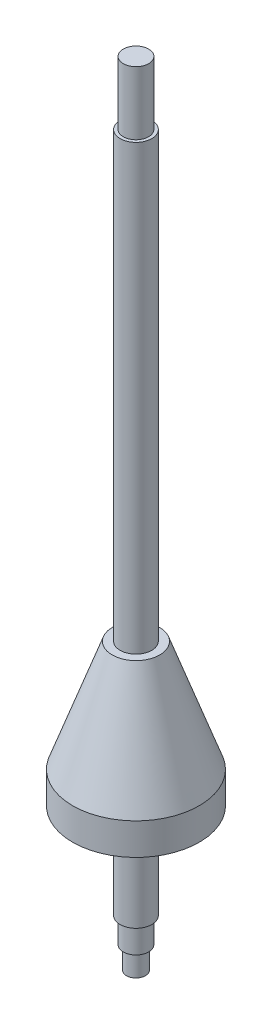
ISO-10303-21;
HEADER;
FILE_DESCRIPTION(('STEP AP214'),'2;1');
FILE_NAME('part.step','',(''),(''),'','','');
FILE_SCHEMA(('AUTOMOTIVE_DESIGN { 1 0 10303 214 1 1 1 1 }'));
ENDSEC;
DATA;
#1=APPLICATION_CONTEXT('core data for automotive mechanical design processes');
#2=APPLICATION_PROTOCOL_DEFINITION('international standard','automotive_design',2000,#1);
#3=PRODUCT_CONTEXT('',#1,'mechanical');
#4=PRODUCT('Part','Part','',(#3));
#5=PRODUCT_RELATED_PRODUCT_CATEGORY('part','',(#4));
#6=PRODUCT_DEFINITION_FORMATION('','',#4);
#7=PRODUCT_DEFINITION_CONTEXT('part definition',#1,'design');
#8=PRODUCT_DEFINITION('design','',#6,#7);
#9=PRODUCT_DEFINITION_SHAPE('','',#8);
#10=(LENGTH_UNIT() NAMED_UNIT(*) SI_UNIT(.MILLI.,.METRE.));
#11=(NAMED_UNIT(*) PLANE_ANGLE_UNIT() SI_UNIT($,.RADIAN.));
#12=(NAMED_UNIT(*) SI_UNIT($,.STERADIAN.) SOLID_ANGLE_UNIT());
#13=UNCERTAINTY_MEASURE_WITH_UNIT(LENGTH_MEASURE(1.E-05),#10,'distance_accuracy_value','');
#14=(GEOMETRIC_REPRESENTATION_CONTEXT(3) GLOBAL_UNCERTAINTY_ASSIGNED_CONTEXT((#13)) GLOBAL_UNIT_ASSIGNED_CONTEXT((#10,
#11,#12)) REPRESENTATION_CONTEXT('',''));
#15=CARTESIAN_POINT('',(0.,0.,0.));
#16=DIRECTION('',(0.,0.,1.));
#17=DIRECTION('',(1.,0.,0.));
#18=AXIS2_PLACEMENT_3D('',#15,#16,#17);
#19=CARTESIAN_POINT('',(0.,266.579730289978,0.));
#20=DIRECTION('',(0.,1.,0.));
#21=DIRECTION('',(0.,0.,1.));
#22=AXIS2_PLACEMENT_3D('',#19,#20,#21);
#23=CYLINDRICAL_SURFACE('',#22,20.);
#24=CARTESIAN_POINT('',(0.,10.,0.));
#25=DIRECTION('',(0.,1.,0.));
#26=DIRECTION('',(0.,0.,1.));
#27=AXIS2_PLACEMENT_3D('',#24,#25,#26);
#28=CIRCLE('',#27,20.);
#29=CARTESIAN_POINT('',(0.,10.,20.));
#30=VERTEX_POINT('',#29);
#31=EDGE_CURVE('E10',#30,#30,#28,.T.);
#32=ORIENTED_EDGE('',*,*,#31,.F.);
#33=EDGE_LOOP('',(#32));
#34=FACE_BOUND('',#33,.T.);
#35=CARTESIAN_POINT('',(0.,0.,0.));
#36=DIRECTION('',(0.,1.,0.));
#37=DIRECTION('',(0.,0.,1.));
#38=AXIS2_PLACEMENT_3D('',#35,#36,#37);
#39=CIRCLE('',#38,20.);
#40=CARTESIAN_POINT('',(0.,0.,20.));
#41=VERTEX_POINT('',#40);
#42=EDGE_CURVE('E80',#41,#41,#39,.T.);
#43=ORIENTED_EDGE('',*,*,#42,.T.);
#44=EDGE_LOOP('',(#43));
#45=FACE_BOUND('',#44,.T.);
#46=ADVANCED_FACE('F31',(#34,#45),#23,.T.);
#47=CARTESIAN_POINT('',(0.,10.,0.));
#48=DIRECTION('',(0.,-1.,0.));
#49=DIRECTION('',(0.,0.,-1.));
#50=AXIS2_PLACEMENT_3D('',#47,#48,#49);
#51=CONICAL_SURFACE('',#50,20.,0.343023940420703);
#52=CARTESIAN_POINT('',(0.,45.,0.));
#53=DIRECTION('',(0.,1.,0.));
#54=DIRECTION('',(0.,0.,1.));
#55=AXIS2_PLACEMENT_3D('',#52,#53,#54);
#56=CIRCLE('',#55,7.50000000000002);
#57=CARTESIAN_POINT('',(0.,45.,7.50000000000002));
#58=VERTEX_POINT('',#57);
#59=EDGE_CURVE('E37',#58,#58,#56,.T.);
#60=ORIENTED_EDGE('',*,*,#59,.F.);
#61=EDGE_LOOP('',(#60));
#62=FACE_BOUND('',#61,.T.);
#63=ORIENTED_EDGE('',*,*,#31,.T.);
#64=EDGE_LOOP('',(#63));
#65=FACE_BOUND('',#64,.T.);
#66=ADVANCED_FACE('F144',(#62,#65),#51,.T.);
#67=CARTESIAN_POINT('',(7.50000000000002,45.,0.));
#68=DIRECTION('',(0.,-1.,0.));
#69=DIRECTION('',(0.,0.,-1.));
#70=AXIS2_PLACEMENT_3D('',#67,#68,#69);
#71=PLANE('',#70);
#72=CARTESIAN_POINT('',(0.,45.,0.));
#73=DIRECTION('',(0.,1.,0.));
#74=DIRECTION('',(0.,0.,1.));
#75=AXIS2_PLACEMENT_3D('',#72,#73,#74);
#76=CIRCLE('',#75,5.00000000000001);
#77=CARTESIAN_POINT('',(0.,45.,5.00000000000001));
#78=VERTEX_POINT('',#77);
#79=EDGE_CURVE('E41',#78,#78,#76,.T.);
#80=ORIENTED_EDGE('',*,*,#79,.F.);
#81=EDGE_LOOP('',(#80));
#82=FACE_BOUND('',#81,.T.);
#83=ORIENTED_EDGE('',*,*,#59,.T.);
#84=EDGE_LOOP('',(#83));
#85=FACE_BOUND('',#84,.T.);
#86=ADVANCED_FACE('F149',(#82,#85),#71,.F.);
#87=CARTESIAN_POINT('',(0.,266.579730289978,0.));
#88=DIRECTION('',(0.,1.,0.));
#89=DIRECTION('',(0.,0.,1.));
#90=AXIS2_PLACEMENT_3D('',#87,#88,#89);
#91=CYLINDRICAL_SURFACE('',#90,5.);
#92=CARTESIAN_POINT('',(0.,185.,0.));
#93=DIRECTION('',(0.,1.,0.));
#94=DIRECTION('',(0.,0.,1.));
#95=AXIS2_PLACEMENT_3D('',#92,#93,#94);
#96=CIRCLE('',#95,5.);
#97=CARTESIAN_POINT('',(0.,185.,5.));
#98=VERTEX_POINT('',#97);
#99=EDGE_CURVE('E45',#98,#98,#96,.T.);
#100=ORIENTED_EDGE('',*,*,#99,.F.);
#101=EDGE_LOOP('',(#100));
#102=FACE_BOUND('',#101,.T.);
#103=ORIENTED_EDGE('',*,*,#79,.T.);
#104=EDGE_LOOP('',(#103));
#105=FACE_BOUND('',#104,.T.);
#106=ADVANCED_FACE('F154',(#102,#105),#91,.T.);
#107=CARTESIAN_POINT('',(5.,185.,0.));
#108=DIRECTION('',(0.,-1.,0.));
#109=DIRECTION('',(0.,0.,-1.));
#110=AXIS2_PLACEMENT_3D('',#107,#108,#109);
#111=PLANE('',#110);
#112=CARTESIAN_POINT('',(0.,185.,0.));
#113=DIRECTION('',(0.,1.,0.));
#114=DIRECTION('',(0.,0.,1.));
#115=AXIS2_PLACEMENT_3D('',#112,#113,#114);
#116=CIRCLE('',#115,4.00000000000001);
#117=CARTESIAN_POINT('',(0.,185.,4.00000000000001));
#118=VERTEX_POINT('',#117);
#119=EDGE_CURVE('E50',#118,#118,#116,.T.);
#120=ORIENTED_EDGE('',*,*,#119,.F.);
#121=EDGE_LOOP('',(#120));
#122=FACE_BOUND('',#121,.T.);
#123=ORIENTED_EDGE('',*,*,#99,.T.);
#124=EDGE_LOOP('',(#123));
#125=FACE_BOUND('',#124,.T.);
#126=ADVANCED_FACE('F160',(#122,#125),#111,.F.);
#127=CARTESIAN_POINT('',(0.,266.579730289978,0.));
#128=DIRECTION('',(0.,1.,0.));
#129=DIRECTION('',(0.,0.,1.));
#130=AXIS2_PLACEMENT_3D('',#127,#128,#129);
#131=CYLINDRICAL_SURFACE('',#130,4.);
#132=CARTESIAN_POINT('',(0.,205.,0.));
#133=DIRECTION('',(0.,1.,0.));
#134=DIRECTION('',(0.,0.,1.));
#135=AXIS2_PLACEMENT_3D('',#132,#133,#134);
#136=CIRCLE('',#135,4.);
#137=CARTESIAN_POINT('',(0.,205.,4.));
#138=VERTEX_POINT('',#137);
#139=EDGE_CURVE('E53',#138,#138,#136,.T.);
#140=ORIENTED_EDGE('',*,*,#139,.F.);
#141=EDGE_LOOP('',(#140));
#142=FACE_BOUND('',#141,.T.);
#143=ORIENTED_EDGE('',*,*,#119,.T.);
#144=EDGE_LOOP('',(#143));
#145=FACE_BOUND('',#144,.T.);
#146=ADVANCED_FACE('F140',(#142,#145),#131,.T.);
#147=CARTESIAN_POINT('',(4.,205.,0.));
#148=DIRECTION('',(0.,-1.,0.));
#149=DIRECTION('',(0.,0.,-1.));
#150=AXIS2_PLACEMENT_3D('',#147,#148,#149);
#151=PLANE('',#150);
#152=ORIENTED_EDGE('',*,*,#139,.T.);
#153=EDGE_LOOP('',(#152));
#154=FACE_BOUND('',#153,.T.);
#155=ADVANCED_FACE('F135',(#154),#151,.F.);
#156=CARTESIAN_POINT('',(3.00000000000003,-45.,0.));
#157=DIRECTION('',(0.,1.,0.));
#158=DIRECTION('',(0.,0.,1.));
#159=AXIS2_PLACEMENT_3D('',#156,#157,#158);
#160=PLANE('',#159);
#161=CARTESIAN_POINT('',(0.,-45.,0.));
#162=DIRECTION('',(0.,1.,0.));
#163=DIRECTION('',(0.,0.,1.));
#164=AXIS2_PLACEMENT_3D('',#161,#162,#163);
#165=CIRCLE('',#164,3.00000000000003);
#166=CARTESIAN_POINT('',(0.,-45.,3.00000000000003));
#167=VERTEX_POINT('',#166);
#168=EDGE_CURVE('E56',#167,#167,#165,.T.);
#169=ORIENTED_EDGE('',*,*,#168,.F.);
#170=EDGE_LOOP('',(#169));
#171=FACE_BOUND('',#170,.T.);
#172=ADVANCED_FACE('F130',(#171),#160,.F.);
#173=CARTESIAN_POINT('',(0.,266.579730289978,0.));
#174=DIRECTION('',(0.,1.,0.));
#175=DIRECTION('',(0.,0.,1.));
#176=AXIS2_PLACEMENT_3D('',#173,#174,#175);
#177=CYLINDRICAL_SURFACE('',#176,3.00000000000003);
#178=CARTESIAN_POINT('',(0.,-38.,0.));
#179=DIRECTION('',(0.,1.,0.));
#180=DIRECTION('',(0.,0.,1.));
#181=AXIS2_PLACEMENT_3D('',#178,#179,#180);
#182=CIRCLE('',#181,3.00000000000003);
#183=CARTESIAN_POINT('',(0.,-38.,3.00000000000003));
#184=VERTEX_POINT('',#183);
#185=EDGE_CURVE('E59',#184,#184,#182,.T.);
#186=ORIENTED_EDGE('',*,*,#185,.F.);
#187=EDGE_LOOP('',(#186));
#188=FACE_BOUND('',#187,.T.);
#189=ORIENTED_EDGE('',*,*,#168,.T.);
#190=EDGE_LOOP('',(#189));
#191=FACE_BOUND('',#190,.T.);
#192=ADVANCED_FACE('F124',(#188,#191),#177,.T.);
#193=CARTESIAN_POINT('',(4.00000000000003,-38.,0.));
#194=DIRECTION('',(0.,1.,0.));
#195=DIRECTION('',(0.,0.,1.));
#196=AXIS2_PLACEMENT_3D('',#193,#194,#195);
#197=PLANE('',#196);
#198=CARTESIAN_POINT('',(0.,-38.,0.));
#199=DIRECTION('',(0.,1.,0.));
#200=DIRECTION('',(0.,0.,1.));
#201=AXIS2_PLACEMENT_3D('',#198,#199,#200);
#202=CIRCLE('',#201,4.00000000000003);
#203=CARTESIAN_POINT('',(0.,-38.,4.00000000000003));
#204=VERTEX_POINT('',#203);
#205=EDGE_CURVE('E62',#204,#204,#202,.T.);
#206=ORIENTED_EDGE('',*,*,#205,.F.);
#207=EDGE_LOOP('',(#206));
#208=FACE_BOUND('',#207,.T.);
#209=ORIENTED_EDGE('',*,*,#185,.T.);
#210=EDGE_LOOP('',(#209));
#211=FACE_BOUND('',#210,.T.);
#212=ADVANCED_FACE('F118',(#208,#211),#197,.F.);
#213=CARTESIAN_POINT('',(0.,266.579730289978,0.));
#214=DIRECTION('',(0.,1.,0.));
#215=DIRECTION('',(0.,0.,1.));
#216=AXIS2_PLACEMENT_3D('',#213,#214,#215);
#217=CYLINDRICAL_SURFACE('',#216,4.00000000000003);
#218=CARTESIAN_POINT('',(0.,-30.,0.));
#219=DIRECTION('',(0.,1.,0.));
#220=DIRECTION('',(0.,0.,1.));
#221=AXIS2_PLACEMENT_3D('',#218,#219,#220);
#222=CIRCLE('',#221,4.00000000000003);
#223=CARTESIAN_POINT('',(0.,-30.,4.00000000000003));
#224=VERTEX_POINT('',#223);
#225=EDGE_CURVE('E65',#224,#224,#222,.T.);
#226=ORIENTED_EDGE('',*,*,#225,.F.);
#227=EDGE_LOOP('',(#226));
#228=FACE_BOUND('',#227,.T.);
#229=ORIENTED_EDGE('',*,*,#205,.T.);
#230=EDGE_LOOP('',(#229));
#231=FACE_BOUND('',#230,.T.);
#232=ADVANCED_FACE('F112',(#228,#231),#217,.T.);
#233=CARTESIAN_POINT('',(5.00000000000003,-30.,0.));
#234=DIRECTION('',(0.,1.,0.));
#235=DIRECTION('',(0.,0.,1.));
#236=AXIS2_PLACEMENT_3D('',#233,#234,#235);
#237=PLANE('',#236);
#238=CARTESIAN_POINT('',(0.,-30.,0.));
#239=DIRECTION('',(0.,1.,0.));
#240=DIRECTION('',(0.,0.,1.));
#241=AXIS2_PLACEMENT_3D('',#238,#239,#240);
#242=CIRCLE('',#241,5.00000000000003);
#243=CARTESIAN_POINT('',(0.,-30.,5.00000000000003));
#244=VERTEX_POINT('',#243);
#245=EDGE_CURVE('E68',#244,#244,#242,.T.);
#246=ORIENTED_EDGE('',*,*,#245,.F.);
#247=EDGE_LOOP('',(#246));
#248=FACE_BOUND('',#247,.T.);
#249=ORIENTED_EDGE('',*,*,#225,.T.);
#250=EDGE_LOOP('',(#249));
#251=FACE_BOUND('',#250,.T.);
#252=ADVANCED_FACE('F106',(#248,#251),#237,.F.);
#253=CARTESIAN_POINT('',(0.,266.579730289978,0.));
#254=DIRECTION('',(0.,1.,0.));
#255=DIRECTION('',(0.,0.,1.));
#256=AXIS2_PLACEMENT_3D('',#253,#254,#255);
#257=CYLINDRICAL_SURFACE('',#256,5.00000000000003);
#258=CARTESIAN_POINT('',(0.,-5.,0.));
#259=DIRECTION('',(0.,1.,0.));
#260=DIRECTION('',(0.,0.,1.));
#261=AXIS2_PLACEMENT_3D('',#258,#259,#260);
#262=CIRCLE('',#261,5.00000000000002);
#263=CARTESIAN_POINT('',(0.,-5.,5.00000000000002));
#264=VERTEX_POINT('',#263);
#265=EDGE_CURVE('E71',#264,#264,#262,.T.);
#266=ORIENTED_EDGE('',*,*,#265,.F.);
#267=EDGE_LOOP('',(#266));
#268=FACE_BOUND('',#267,.T.);
#269=ORIENTED_EDGE('',*,*,#245,.T.);
#270=EDGE_LOOP('',(#269));
#271=FACE_BOUND('',#270,.T.);
#272=ADVANCED_FACE('F100',(#268,#271),#257,.T.);
#273=CARTESIAN_POINT('',(10.,-5.,0.));
#274=DIRECTION('',(0.,1.,0.));
#275=DIRECTION('',(0.,0.,1.));
#276=AXIS2_PLACEMENT_3D('',#273,#274,#275);
#277=PLANE('',#276);
#278=CARTESIAN_POINT('',(0.,-5.,0.));
#279=DIRECTION('',(0.,1.,0.));
#280=DIRECTION('',(0.,0.,1.));
#281=AXIS2_PLACEMENT_3D('',#278,#279,#280);
#282=CIRCLE('',#281,10.);
#283=CARTESIAN_POINT('',(0.,-5.,10.));
#284=VERTEX_POINT('',#283);
#285=EDGE_CURVE('E74',#284,#284,#282,.T.);
#286=ORIENTED_EDGE('',*,*,#285,.F.);
#287=EDGE_LOOP('',(#286));
#288=FACE_BOUND('',#287,.T.);
#289=ORIENTED_EDGE('',*,*,#265,.T.);
#290=EDGE_LOOP('',(#289));
#291=FACE_BOUND('',#290,.T.);
#292=ADVANCED_FACE('F94',(#288,#291),#277,.F.);
#293=CARTESIAN_POINT('',(0.,266.579730289978,0.));
#294=DIRECTION('',(0.,1.,0.));
#295=DIRECTION('',(0.,0.,1.));
#296=AXIS2_PLACEMENT_3D('',#293,#294,#295);
#297=CYLINDRICAL_SURFACE('',#296,10.);
#298=CARTESIAN_POINT('',(0.,0.,0.));
#299=DIRECTION('',(0.,1.,0.));
#300=DIRECTION('',(0.,0.,1.));
#301=AXIS2_PLACEMENT_3D('',#298,#299,#300);
#302=CIRCLE('',#301,10.);
#303=CARTESIAN_POINT('',(0.,0.,10.));
#304=VERTEX_POINT('',#303);
#305=EDGE_CURVE('E77',#304,#304,#302,.T.);
#306=ORIENTED_EDGE('',*,*,#305,.F.);
#307=EDGE_LOOP('',(#306));
#308=FACE_BOUND('',#307,.T.);
#309=ORIENTED_EDGE('',*,*,#285,.T.);
#310=EDGE_LOOP('',(#309));
#311=FACE_BOUND('',#310,.T.);
#312=ADVANCED_FACE('F88',(#308,#311),#297,.T.);
#313=CARTESIAN_POINT('',(10.,0.,0.));
#314=DIRECTION('',(0.,1.,0.));
#315=DIRECTION('',(0.,0.,1.));
#316=AXIS2_PLACEMENT_3D('',#313,#314,#315);
#317=PLANE('',#316);
#318=ORIENTED_EDGE('',*,*,#42,.F.);
#319=EDGE_LOOP('',(#318));
#320=FACE_BOUND('',#319,.T.);
#321=ORIENTED_EDGE('',*,*,#305,.T.);
#322=EDGE_LOOP('',(#321));
#323=FACE_BOUND('',#322,.T.);
#324=ADVANCED_FACE('F85',(#320,#323),#317,.F.);
#325=CLOSED_SHELL('',(#46,#66,#86,#106,#126,#146,#155,#172,#192,#212,#232,#252,#272,#292,#312,#324));
#326=MANIFOLD_SOLID_BREP('B2',#325);
#327=ADVANCED_BREP_SHAPE_REPRESENTATION('',(#18,#326),#14);
#328=SHAPE_DEFINITION_REPRESENTATION(#9,#327);
ENDSEC;
END-ISO-10303-21;
